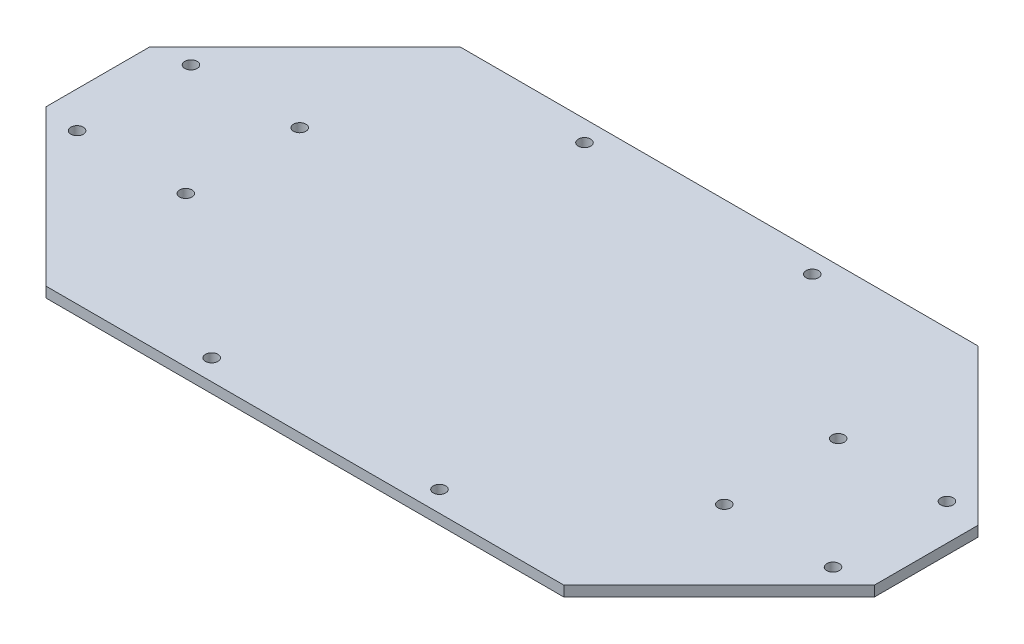
ISO-10303-21;
HEADER;
FILE_DESCRIPTION(('STEP AP214'),'2;1');
FILE_NAME('part.step','',(''),(''),'','','');
FILE_SCHEMA(('AUTOMOTIVE_DESIGN { 1 0 10303 214 1 1 1 1 }'));
ENDSEC;
DATA;
#1=APPLICATION_CONTEXT('core data for automotive mechanical design processes');
#2=APPLICATION_PROTOCOL_DEFINITION('international standard','automotive_design',2000,#1);
#3=PRODUCT_CONTEXT('',#1,'mechanical');
#4=PRODUCT('Part','Part','',(#3));
#5=PRODUCT_RELATED_PRODUCT_CATEGORY('part','',(#4));
#6=PRODUCT_DEFINITION_FORMATION('','',#4);
#7=PRODUCT_DEFINITION_CONTEXT('part definition',#1,'design');
#8=PRODUCT_DEFINITION('design','',#6,#7);
#9=PRODUCT_DEFINITION_SHAPE('','',#8);
#10=(LENGTH_UNIT() NAMED_UNIT(*) SI_UNIT(.MILLI.,.METRE.));
#11=(NAMED_UNIT(*) PLANE_ANGLE_UNIT() SI_UNIT($,.RADIAN.));
#12=(NAMED_UNIT(*) SI_UNIT($,.STERADIAN.) SOLID_ANGLE_UNIT());
#13=UNCERTAINTY_MEASURE_WITH_UNIT(LENGTH_MEASURE(1.E-05),#10,'distance_accuracy_value','');
#14=(GEOMETRIC_REPRESENTATION_CONTEXT(3) GLOBAL_UNCERTAINTY_ASSIGNED_CONTEXT((#13)) GLOBAL_UNIT_ASSIGNED_CONTEXT((#10,
#11,#12)) REPRESENTATION_CONTEXT('',''));
#15=CARTESIAN_POINT('',(0.,0.,0.));
#16=DIRECTION('',(0.,0.,1.));
#17=DIRECTION('',(1.,0.,0.));
#18=AXIS2_PLACEMENT_3D('',#15,#16,#17);
#19=CARTESIAN_POINT('',(0.,2.,0.));
#20=DIRECTION('',(0.,-1.,0.));
#21=DIRECTION('',(0.,0.,-1.));
#22=AXIS2_PLACEMENT_3D('',#19,#20,#21);
#23=PLANE('',#22);
#24=CARTESIAN_POINT('',(7.,2.,-51.0000000000001));
#25=DIRECTION('',(0.,1.,0.));
#26=DIRECTION('',(0.,0.,1.));
#27=AXIS2_PLACEMENT_3D('',#24,#25,#26);
#28=CIRCLE('',#27,1.19999999999999);
#29=CARTESIAN_POINT('',(7.,2.,-49.8000000000001));
#30=VERTEX_POINT('',#29);
#31=EDGE_CURVE('E392',#30,#30,#28,.T.);
#32=ORIENTED_EDGE('',*,*,#31,.F.);
#33=EDGE_LOOP('',(#32));
#34=FACE_BOUND('',#33,.T.);
#35=CARTESIAN_POINT('',(7.00000000000001,2.,-29.0000000000001));
#36=DIRECTION('',(0.,1.,0.));
#37=DIRECTION('',(0.,0.,1.));
#38=AXIS2_PLACEMENT_3D('',#35,#36,#37);
#39=CIRCLE('',#38,1.19999999999999);
#40=CARTESIAN_POINT('',(7.00000000000001,2.,-27.8000000000001));
#41=VERTEX_POINT('',#40);
#42=EDGE_CURVE('E394',#41,#41,#39,.T.);
#43=ORIENTED_EDGE('',*,*,#42,.F.);
#44=EDGE_LOOP('',(#43));
#45=FACE_BOUND('',#44,.T.);
#46=CARTESIAN_POINT('',(28.0000000000016,2.,-50.9999999999996));
#47=DIRECTION('',(0.,1.,0.));
#48=DIRECTION('',(0.,0.,1.));
#49=AXIS2_PLACEMENT_3D('',#46,#47,#48);
#50=CIRCLE('',#49,1.19999999999999);
#51=CARTESIAN_POINT('',(28.0000000000016,2.,-49.7999999999996));
#52=VERTEX_POINT('',#51);
#53=EDGE_CURVE('E408',#52,#52,#50,.T.);
#54=ORIENTED_EDGE('',*,*,#53,.F.);
#55=EDGE_LOOP('',(#54));
#56=FACE_BOUND('',#55,.T.);
#57=CARTESIAN_POINT('',(58.0000000000005,2.,-75.9999999999996));
#58=DIRECTION('',(0.,1.,0.));
#59=DIRECTION('',(0.,0.,1.));
#60=AXIS2_PLACEMENT_3D('',#57,#58,#59);
#61=CIRCLE('',#60,1.19999999999999);
#62=CARTESIAN_POINT('',(58.0000000000005,2.,-74.7999999999996));
#63=VERTEX_POINT('',#62);
#64=EDGE_CURVE('E414',#63,#63,#61,.T.);
#65=ORIENTED_EDGE('',*,*,#64,.F.);
#66=EDGE_LOOP('',(#65));
#67=FACE_BOUND('',#66,.T.);
#68=CARTESIAN_POINT('',(58.0000000000007,2.,-3.99999999999956));
#69=DIRECTION('',(0.,1.,0.));
#70=DIRECTION('',(0.,0.,1.));
#71=AXIS2_PLACEMENT_3D('',#68,#69,#70);
#72=CIRCLE('',#71,1.19999999999999);
#73=CARTESIAN_POINT('',(58.0000000000007,2.,-2.79999999999958));
#74=VERTEX_POINT('',#73);
#75=EDGE_CURVE('E420',#74,#74,#72,.T.);
#76=ORIENTED_EDGE('',*,*,#75,.F.);
#77=EDGE_LOOP('',(#76));
#78=FACE_BOUND('',#77,.T.);
#79=CARTESIAN_POINT('',(131.999999999998,2.,-28.9999999999995));
#80=DIRECTION('',(0.,1.,0.));
#81=DIRECTION('',(0.,0.,1.));
#82=AXIS2_PLACEMENT_3D('',#79,#80,#81);
#83=CIRCLE('',#82,1.19999999999998);
#84=CARTESIAN_POINT('',(131.999999999998,2.,-27.7999999999995));
#85=VERTEX_POINT('',#84);
#86=EDGE_CURVE('E426',#85,#85,#83,.T.);
#87=ORIENTED_EDGE('',*,*,#86,.F.);
#88=EDGE_LOOP('',(#87));
#89=FACE_BOUND('',#88,.T.);
#90=CARTESIAN_POINT('',(153.,2.,-29.0000000000001));
#91=DIRECTION('',(0.,1.,0.));
#92=DIRECTION('',(0.,0.,1.));
#93=AXIS2_PLACEMENT_3D('',#90,#91,#92);
#94=CIRCLE('',#93,1.19999999999998);
#95=CARTESIAN_POINT('',(153.,2.,-27.8000000000001));
#96=VERTEX_POINT('',#95);
#97=EDGE_CURVE('E432',#96,#96,#94,.T.);
#98=ORIENTED_EDGE('',*,*,#97,.F.);
#99=EDGE_LOOP('',(#98));
#100=FACE_BOUND('',#99,.T.);
#101=CARTESIAN_POINT('',(153.,2.,-51.0000000000001));
#102=DIRECTION('',(0.,1.,0.));
#103=DIRECTION('',(0.,0.,1.));
#104=AXIS2_PLACEMENT_3D('',#101,#102,#103);
#105=CIRCLE('',#104,1.19999999999998);
#106=CARTESIAN_POINT('',(153.,2.,-49.8000000000001));
#107=VERTEX_POINT('',#106);
#108=EDGE_CURVE('E438',#107,#107,#105,.T.);
#109=ORIENTED_EDGE('',*,*,#108,.F.);
#110=EDGE_LOOP('',(#109));
#111=FACE_BOUND('',#110,.T.);
#112=CARTESIAN_POINT('',(131.999999999998,2.,-50.9999999999995));
#113=DIRECTION('',(0.,1.,0.));
#114=DIRECTION('',(0.,0.,1.));
#115=AXIS2_PLACEMENT_3D('',#112,#113,#114);
#116=CIRCLE('',#115,1.19999999999998);
#117=CARTESIAN_POINT('',(131.999999999998,2.,-49.7999999999995));
#118=VERTEX_POINT('',#117);
#119=EDGE_CURVE('E444',#118,#118,#116,.T.);
#120=ORIENTED_EDGE('',*,*,#119,.F.);
#121=EDGE_LOOP('',(#120));
#122=FACE_BOUND('',#121,.T.);
#123=CARTESIAN_POINT('',(101.994988581029,2.,-75.9999999999996));
#124=DIRECTION('',(0.,1.,0.));
#125=DIRECTION('',(0.,0.,1.));
#126=AXIS2_PLACEMENT_3D('',#123,#124,#125);
#127=CIRCLE('',#126,1.19999999999999);
#128=CARTESIAN_POINT('',(101.994988581029,2.,-74.7999999999996));
#129=VERTEX_POINT('',#128);
#130=EDGE_CURVE('E450',#129,#129,#127,.T.);
#131=ORIENTED_EDGE('',*,*,#130,.F.);
#132=EDGE_LOOP('',(#131));
#133=FACE_BOUND('',#132,.T.);
#134=CARTESIAN_POINT('',(101.994988581029,2.,-3.99999999999956));
#135=DIRECTION('',(0.,1.,0.));
#136=DIRECTION('',(0.,0.,1.));
#137=AXIS2_PLACEMENT_3D('',#134,#135,#136);
#138=CIRCLE('',#137,1.19999999999999);
#139=CARTESIAN_POINT('',(101.994988581029,2.,-2.79999999999957));
#140=VERTEX_POINT('',#139);
#141=EDGE_CURVE('E456',#140,#140,#138,.T.);
#142=ORIENTED_EDGE('',*,*,#141,.F.);
#143=EDGE_LOOP('',(#142));
#144=FACE_BOUND('',#143,.T.);
#145=DIRECTION('',(1.,0.,0.));
#146=VECTOR('',#145,1.);
#147=CARTESIAN_POINT('',(0.,2.,0.));
#148=LINE('',#147,#146);
#149=CARTESIAN_POINT('',(30.,2.,0.));
#150=VERTEX_POINT('',#149);
#151=CARTESIAN_POINT('',(130.,2.,0.));
#152=VERTEX_POINT('',#151);
#153=EDGE_CURVE('E144',#150,#152,#148,.T.);
#154=ORIENTED_EDGE('',*,*,#153,.T.);
#155=DIRECTION('',(-0.707106781186547,0.,0.707106781186547));
#156=VECTOR('',#155,1.);
#157=CARTESIAN_POINT('',(160.,2.,-30.));
#158=LINE('',#157,#156);
#159=CARTESIAN_POINT('',(160.,2.,-30.));
#160=VERTEX_POINT('',#159);
#161=EDGE_CURVE('E158',#160,#152,#158,.T.);
#162=ORIENTED_EDGE('',*,*,#161,.F.);
#163=DIRECTION('',(0.,0.,-1.));
#164=VECTOR('',#163,1.);
#165=CARTESIAN_POINT('',(160.,2.,0.));
#166=LINE('',#165,#164);
#167=CARTESIAN_POINT('',(160.,2.,-50.));
#168=VERTEX_POINT('',#167);
#169=EDGE_CURVE('E46',#160,#168,#166,.T.);
#170=ORIENTED_EDGE('',*,*,#169,.T.);
#171=DIRECTION('',(0.707106781186547,0.,0.707106781186547));
#172=VECTOR('',#171,1.);
#173=CARTESIAN_POINT('',(160.,2.,-50.));
#174=LINE('',#173,#172);
#175=CARTESIAN_POINT('',(130.,2.,-80.));
#176=VERTEX_POINT('',#175);
#177=EDGE_CURVE('E156',#176,#168,#174,.T.);
#178=ORIENTED_EDGE('',*,*,#177,.F.);
#179=DIRECTION('',(-1.,0.,0.));
#180=VECTOR('',#179,1.);
#181=CARTESIAN_POINT('',(0.,2.,-80.));
#182=LINE('',#181,#180);
#183=CARTESIAN_POINT('',(30.,2.,-80.));
#184=VERTEX_POINT('',#183);
#185=EDGE_CURVE('E11',#176,#184,#182,.T.);
#186=ORIENTED_EDGE('',*,*,#185,.T.);
#187=DIRECTION('',(0.707106781186547,0.,-0.707106781186547));
#188=VECTOR('',#187,1.);
#189=CARTESIAN_POINT('',(30.,2.,-80.));
#190=LINE('',#189,#188);
#191=CARTESIAN_POINT('',(0.,2.,-50.));
#192=VERTEX_POINT('',#191);
#193=EDGE_CURVE('E114',#192,#184,#190,.T.);
#194=ORIENTED_EDGE('',*,*,#193,.F.);
#195=DIRECTION('',(0.,0.,1.));
#196=VECTOR('',#195,1.);
#197=CARTESIAN_POINT('',(0.,2.,0.));
#198=LINE('',#197,#196);
#199=CARTESIAN_POINT('',(0.,2.,-30.));
#200=VERTEX_POINT('',#199);
#201=EDGE_CURVE('E122',#192,#200,#198,.T.);
#202=ORIENTED_EDGE('',*,*,#201,.T.);
#203=DIRECTION('',(-0.707106781186547,0.,-0.707106781186547));
#204=VECTOR('',#203,1.);
#205=CARTESIAN_POINT('',(0.,2.,-30.));
#206=LINE('',#205,#204);
#207=EDGE_CURVE('E175',#150,#200,#206,.T.);
#208=ORIENTED_EDGE('',*,*,#207,.F.);
#209=EDGE_LOOP('',(#154,#162,#170,#178,#186,#194,#202,#208));
#210=FACE_BOUND('',#209,.T.);
#211=CARTESIAN_POINT('',(28.0000000000019,2.,-28.9999999999996));
#212=DIRECTION('',(0.,1.,0.));
#213=DIRECTION('',(0.,0.,1.));
#214=AXIS2_PLACEMENT_3D('',#211,#212,#213);
#215=CIRCLE('',#214,1.19999999999999);
#216=CARTESIAN_POINT('',(28.0000000000019,2.,-27.7999999999996));
#217=VERTEX_POINT('',#216);
#218=EDGE_CURVE('E402',#217,#217,#215,.T.);
#219=ORIENTED_EDGE('',*,*,#218,.F.);
#220=EDGE_LOOP('',(#219));
#221=FACE_BOUND('',#220,.T.);
#222=ADVANCED_FACE('F37',(#34,#45,#56,#67,#78,#89,#100,#111,#122,#133,#144,#210,#221),#23,.F.);
#223=CARTESIAN_POINT('',(0.,0.,0.));
#224=DIRECTION('',(0.,-1.,0.));
#225=DIRECTION('',(0.,0.,-1.));
#226=AXIS2_PLACEMENT_3D('',#223,#224,#225);
#227=PLANE('',#226);
#228=CARTESIAN_POINT('',(7.,0.,-51.0000000000001));
#229=DIRECTION('',(0.,1.,0.));
#230=DIRECTION('',(0.,0.,1.));
#231=AXIS2_PLACEMENT_3D('',#228,#229,#230);
#232=CIRCLE('',#231,1.2);
#233=CARTESIAN_POINT('',(7.,0.,-49.8000000000001));
#234=VERTEX_POINT('',#233);
#235=EDGE_CURVE('E390',#234,#234,#232,.T.);
#236=ORIENTED_EDGE('',*,*,#235,.T.);
#237=EDGE_LOOP('',(#236));
#238=FACE_BOUND('',#237,.T.);
#239=CARTESIAN_POINT('',(7.00000000000001,0.,-29.0000000000001));
#240=DIRECTION('',(0.,1.,0.));
#241=DIRECTION('',(0.,0.,1.));
#242=AXIS2_PLACEMENT_3D('',#239,#240,#241);
#243=CIRCLE('',#242,1.2);
#244=CARTESIAN_POINT('',(7.00000000000001,0.,-27.8000000000001));
#245=VERTEX_POINT('',#244);
#246=EDGE_CURVE('E399',#245,#245,#243,.T.);
#247=ORIENTED_EDGE('',*,*,#246,.T.);
#248=EDGE_LOOP('',(#247));
#249=FACE_BOUND('',#248,.T.);
#250=CARTESIAN_POINT('',(28.0000000000019,0.,-28.9999999999996));
#251=DIRECTION('',(0.,1.,0.));
#252=DIRECTION('',(0.,0.,1.));
#253=AXIS2_PLACEMENT_3D('',#250,#251,#252);
#254=CIRCLE('',#253,1.2);
#255=CARTESIAN_POINT('',(28.0000000000019,0.,-27.7999999999996));
#256=VERTEX_POINT('',#255);
#257=EDGE_CURVE('E405',#256,#256,#254,.T.);
#258=ORIENTED_EDGE('',*,*,#257,.T.);
#259=EDGE_LOOP('',(#258));
#260=FACE_BOUND('',#259,.T.);
#261=CARTESIAN_POINT('',(28.0000000000016,0.,-50.9999999999996));
#262=DIRECTION('',(0.,1.,0.));
#263=DIRECTION('',(0.,0.,1.));
#264=AXIS2_PLACEMENT_3D('',#261,#262,#263);
#265=CIRCLE('',#264,1.2);
#266=CARTESIAN_POINT('',(28.0000000000016,0.,-49.7999999999996));
#267=VERTEX_POINT('',#266);
#268=EDGE_CURVE('E411',#267,#267,#265,.T.);
#269=ORIENTED_EDGE('',*,*,#268,.T.);
#270=EDGE_LOOP('',(#269));
#271=FACE_BOUND('',#270,.T.);
#272=CARTESIAN_POINT('',(58.0000000000005,0.,-75.9999999999996));
#273=DIRECTION('',(0.,1.,0.));
#274=DIRECTION('',(0.,0.,1.));
#275=AXIS2_PLACEMENT_3D('',#272,#273,#274);
#276=CIRCLE('',#275,1.2);
#277=CARTESIAN_POINT('',(58.0000000000005,0.,-74.7999999999996));
#278=VERTEX_POINT('',#277);
#279=EDGE_CURVE('E417',#278,#278,#276,.T.);
#280=ORIENTED_EDGE('',*,*,#279,.T.);
#281=EDGE_LOOP('',(#280));
#282=FACE_BOUND('',#281,.T.);
#283=CARTESIAN_POINT('',(58.0000000000007,0.,-3.99999999999956));
#284=DIRECTION('',(0.,1.,0.));
#285=DIRECTION('',(0.,0.,1.));
#286=AXIS2_PLACEMENT_3D('',#283,#284,#285);
#287=CIRCLE('',#286,1.2);
#288=CARTESIAN_POINT('',(58.0000000000007,0.,-2.79999999999957));
#289=VERTEX_POINT('',#288);
#290=EDGE_CURVE('E423',#289,#289,#287,.T.);
#291=ORIENTED_EDGE('',*,*,#290,.T.);
#292=EDGE_LOOP('',(#291));
#293=FACE_BOUND('',#292,.T.);
#294=CARTESIAN_POINT('',(131.999999999998,0.,-28.9999999999995));
#295=DIRECTION('',(0.,1.,0.));
#296=DIRECTION('',(0.,0.,1.));
#297=AXIS2_PLACEMENT_3D('',#294,#295,#296);
#298=CIRCLE('',#297,1.20000000000001);
#299=CARTESIAN_POINT('',(131.999999999998,0.,-27.7999999999995));
#300=VERTEX_POINT('',#299);
#301=EDGE_CURVE('E429',#300,#300,#298,.T.);
#302=ORIENTED_EDGE('',*,*,#301,.T.);
#303=EDGE_LOOP('',(#302));
#304=FACE_BOUND('',#303,.T.);
#305=DIRECTION('',(-0.707106781186547,0.,0.707106781186547));
#306=VECTOR('',#305,1.);
#307=CARTESIAN_POINT('',(160.,0.,-30.));
#308=LINE('',#307,#306);
#309=CARTESIAN_POINT('',(160.,0.,-30.));
#310=VERTEX_POINT('',#309);
#311=CARTESIAN_POINT('',(130.,0.,0.));
#312=VERTEX_POINT('',#311);
#313=EDGE_CURVE('E168',#310,#312,#308,.T.);
#314=ORIENTED_EDGE('',*,*,#313,.T.);
#315=DIRECTION('',(1.,0.,0.));
#316=VECTOR('',#315,1.);
#317=CARTESIAN_POINT('',(0.,0.,0.));
#318=LINE('',#317,#316);
#319=CARTESIAN_POINT('',(30.,0.,0.));
#320=VERTEX_POINT('',#319);
#321=EDGE_CURVE('E129',#320,#312,#318,.T.);
#322=ORIENTED_EDGE('',*,*,#321,.F.);
#323=DIRECTION('',(-0.707106781186547,0.,-0.707106781186547));
#324=VECTOR('',#323,1.);
#325=CARTESIAN_POINT('',(0.,0.,-30.));
#326=LINE('',#325,#324);
#327=CARTESIAN_POINT('',(0.,0.,-30.));
#328=VERTEX_POINT('',#327);
#329=EDGE_CURVE('E128',#320,#328,#326,.T.);
#330=ORIENTED_EDGE('',*,*,#329,.T.);
#331=DIRECTION('',(0.,0.,1.));
#332=VECTOR('',#331,1.);
#333=CARTESIAN_POINT('',(0.,0.,0.));
#334=LINE('',#333,#332);
#335=CARTESIAN_POINT('',(0.,0.,-50.));
#336=VERTEX_POINT('',#335);
#337=EDGE_CURVE('E120',#336,#328,#334,.T.);
#338=ORIENTED_EDGE('',*,*,#337,.F.);
#339=DIRECTION('',(0.707106781186547,0.,-0.707106781186547));
#340=VECTOR('',#339,1.);
#341=CARTESIAN_POINT('',(30.,0.,-80.));
#342=LINE('',#341,#340);
#343=CARTESIAN_POINT('',(30.,0.,-80.));
#344=VERTEX_POINT('',#343);
#345=EDGE_CURVE('E103',#336,#344,#342,.T.);
#346=ORIENTED_EDGE('',*,*,#345,.T.);
#347=DIRECTION('',(-1.,0.,0.));
#348=VECTOR('',#347,1.);
#349=CARTESIAN_POINT('',(0.,0.,-80.));
#350=LINE('',#349,#348);
#351=CARTESIAN_POINT('',(130.,0.,-80.));
#352=VERTEX_POINT('',#351);
#353=EDGE_CURVE('E41',#352,#344,#350,.T.);
#354=ORIENTED_EDGE('',*,*,#353,.F.);
#355=DIRECTION('',(0.707106781186547,0.,0.707106781186547));
#356=VECTOR('',#355,1.);
#357=CARTESIAN_POINT('',(160.,0.,-50.));
#358=LINE('',#357,#356);
#359=CARTESIAN_POINT('',(160.,0.,-50.));
#360=VERTEX_POINT('',#359);
#361=EDGE_CURVE('E162',#352,#360,#358,.T.);
#362=ORIENTED_EDGE('',*,*,#361,.T.);
#363=DIRECTION('',(0.,0.,-1.));
#364=VECTOR('',#363,1.);
#365=CARTESIAN_POINT('',(160.,0.,0.));
#366=LINE('',#365,#364);
#367=EDGE_CURVE('E133',#310,#360,#366,.T.);
#368=ORIENTED_EDGE('',*,*,#367,.F.);
#369=EDGE_LOOP('',(#314,#322,#330,#338,#346,#354,#362,#368));
#370=FACE_BOUND('',#369,.T.);
#371=CARTESIAN_POINT('',(101.994988581029,0.,-3.99999999999956));
#372=DIRECTION('',(0.,1.,0.));
#373=DIRECTION('',(0.,0.,1.));
#374=AXIS2_PLACEMENT_3D('',#371,#372,#373);
#375=CIRCLE('',#374,1.19999999999999);
#376=CARTESIAN_POINT('',(101.994988581029,0.,-2.79999999999957));
#377=VERTEX_POINT('',#376);
#378=EDGE_CURVE('E171',#377,#377,#375,.T.);
#379=ORIENTED_EDGE('',*,*,#378,.T.);
#380=EDGE_LOOP('',(#379));
#381=FACE_BOUND('',#380,.T.);
#382=CARTESIAN_POINT('',(101.994988581029,0.,-75.9999999999996));
#383=DIRECTION('',(0.,1.,0.));
#384=DIRECTION('',(0.,0.,1.));
#385=AXIS2_PLACEMENT_3D('',#382,#383,#384);
#386=CIRCLE('',#385,1.19999999999999);
#387=CARTESIAN_POINT('',(101.994988581029,0.,-74.7999999999996));
#388=VERTEX_POINT('',#387);
#389=EDGE_CURVE('E453',#388,#388,#386,.T.);
#390=ORIENTED_EDGE('',*,*,#389,.T.);
#391=EDGE_LOOP('',(#390));
#392=FACE_BOUND('',#391,.T.);
#393=CARTESIAN_POINT('',(131.999999999998,0.,-50.9999999999995));
#394=DIRECTION('',(0.,1.,0.));
#395=DIRECTION('',(0.,0.,1.));
#396=AXIS2_PLACEMENT_3D('',#393,#394,#395);
#397=CIRCLE('',#396,1.20000000000001);
#398=CARTESIAN_POINT('',(131.999999999998,0.,-49.7999999999995));
#399=VERTEX_POINT('',#398);
#400=EDGE_CURVE('E447',#399,#399,#397,.T.);
#401=ORIENTED_EDGE('',*,*,#400,.T.);
#402=EDGE_LOOP('',(#401));
#403=FACE_BOUND('',#402,.T.);
#404=CARTESIAN_POINT('',(153.,0.,-51.0000000000001));
#405=DIRECTION('',(0.,1.,0.));
#406=DIRECTION('',(0.,0.,1.));
#407=AXIS2_PLACEMENT_3D('',#404,#405,#406);
#408=CIRCLE('',#407,1.20000000000001);
#409=CARTESIAN_POINT('',(153.,0.,-49.8000000000001));
#410=VERTEX_POINT('',#409);
#411=EDGE_CURVE('E441',#410,#410,#408,.T.);
#412=ORIENTED_EDGE('',*,*,#411,.T.);
#413=EDGE_LOOP('',(#412));
#414=FACE_BOUND('',#413,.T.);
#415=CARTESIAN_POINT('',(153.,0.,-29.0000000000001));
#416=DIRECTION('',(0.,1.,0.));
#417=DIRECTION('',(0.,0.,1.));
#418=AXIS2_PLACEMENT_3D('',#415,#416,#417);
#419=CIRCLE('',#418,1.20000000000001);
#420=CARTESIAN_POINT('',(153.,0.,-27.8000000000001));
#421=VERTEX_POINT('',#420);
#422=EDGE_CURVE('E435',#421,#421,#419,.T.);
#423=ORIENTED_EDGE('',*,*,#422,.T.);
#424=EDGE_LOOP('',(#423));
#425=FACE_BOUND('',#424,.T.);
#426=ADVANCED_FACE('F125',(#238,#249,#260,#271,#282,#293,#304,#370,#381,#392,#403,#414,#425),
#227,.T.);
#427=CARTESIAN_POINT('',(0.,2.,0.));
#428=DIRECTION('',(1.,0.,0.));
#429=DIRECTION('',(0.,0.,-1.));
#430=AXIS2_PLACEMENT_3D('',#427,#428,#429);
#431=PLANE('',#430);
#432=ORIENTED_EDGE('',*,*,#201,.F.);
#433=DIRECTION('',(0.,1.,0.));
#434=VECTOR('',#433,1.);
#435=CARTESIAN_POINT('',(0.,0.,-50.));
#436=LINE('',#435,#434);
#437=EDGE_CURVE('E106',#336,#192,#436,.T.);
#438=ORIENTED_EDGE('',*,*,#437,.F.);
#439=ORIENTED_EDGE('',*,*,#337,.T.);
#440=DIRECTION('',(0.,1.,0.));
#441=VECTOR('',#440,1.);
#442=CARTESIAN_POINT('',(0.,0.,-30.));
#443=LINE('',#442,#441);
#444=EDGE_CURVE('E130',#328,#200,#443,.T.);
#445=ORIENTED_EDGE('',*,*,#444,.T.);
#446=EDGE_LOOP('',(#432,#438,#439,#445));
#447=FACE_BOUND('',#446,.T.);
#448=ADVANCED_FACE('F39',(#447),#431,.F.);
#449=CARTESIAN_POINT('',(0.,2.,0.));
#450=DIRECTION('',(0.,0.,-1.));
#451=DIRECTION('',(-1.,0.,0.));
#452=AXIS2_PLACEMENT_3D('',#449,#450,#451);
#453=PLANE('',#452);
#454=ORIENTED_EDGE('',*,*,#321,.T.);
#455=DIRECTION('',(0.,1.,0.));
#456=VECTOR('',#455,1.);
#457=CARTESIAN_POINT('',(130.,0.,0.));
#458=LINE('',#457,#456);
#459=EDGE_CURVE('E54',#312,#152,#458,.T.);
#460=ORIENTED_EDGE('',*,*,#459,.T.);
#461=ORIENTED_EDGE('',*,*,#153,.F.);
#462=DIRECTION('',(0.,1.,0.));
#463=VECTOR('',#462,1.);
#464=CARTESIAN_POINT('',(30.,0.,0.));
#465=LINE('',#464,#463);
#466=EDGE_CURVE('E135',#320,#150,#465,.T.);
#467=ORIENTED_EDGE('',*,*,#466,.F.);
#468=EDGE_LOOP('',(#454,#460,#461,#467));
#469=FACE_BOUND('',#468,.T.);
#470=ADVANCED_FACE('F183',(#469),#453,.F.);
#471=CARTESIAN_POINT('',(160.,2.,0.));
#472=DIRECTION('',(-1.,0.,0.));
#473=DIRECTION('',(0.,0.,1.));
#474=AXIS2_PLACEMENT_3D('',#471,#472,#473);
#475=PLANE('',#474);
#476=ORIENTED_EDGE('',*,*,#169,.F.);
#477=DIRECTION('',(0.,1.,0.));
#478=VECTOR('',#477,1.);
#479=CARTESIAN_POINT('',(160.,0.,-30.));
#480=LINE('',#479,#478);
#481=EDGE_CURVE('E160',#310,#160,#480,.T.);
#482=ORIENTED_EDGE('',*,*,#481,.F.);
#483=ORIENTED_EDGE('',*,*,#367,.T.);
#484=DIRECTION('',(0.,1.,0.));
#485=VECTOR('',#484,1.);
#486=CARTESIAN_POINT('',(160.,0.,-50.));
#487=LINE('',#486,#485);
#488=EDGE_CURVE('E62',#360,#168,#487,.T.);
#489=ORIENTED_EDGE('',*,*,#488,.T.);
#490=EDGE_LOOP('',(#476,#482,#483,#489));
#491=FACE_BOUND('',#490,.T.);
#492=ADVANCED_FACE('F159',(#491),#475,.F.);
#493=CARTESIAN_POINT('',(0.,2.,-80.));
#494=DIRECTION('',(0.,0.,1.));
#495=DIRECTION('',(1.,0.,0.));
#496=AXIS2_PLACEMENT_3D('',#493,#494,#495);
#497=PLANE('',#496);
#498=ORIENTED_EDGE('',*,*,#185,.F.);
#499=DIRECTION('',(0.,1.,0.));
#500=VECTOR('',#499,1.);
#501=CARTESIAN_POINT('',(130.,0.,-80.));
#502=LINE('',#501,#500);
#503=EDGE_CURVE('E161',#352,#176,#502,.T.);
#504=ORIENTED_EDGE('',*,*,#503,.F.);
#505=ORIENTED_EDGE('',*,*,#353,.T.);
#506=DIRECTION('',(0.,1.,0.));
#507=VECTOR('',#506,1.);
#508=CARTESIAN_POINT('',(30.,0.,-80.));
#509=LINE('',#508,#507);
#510=EDGE_CURVE('E109',#344,#184,#509,.T.);
#511=ORIENTED_EDGE('',*,*,#510,.T.);
#512=EDGE_LOOP('',(#498,#504,#505,#511));
#513=FACE_BOUND('',#512,.T.);
#514=ADVANCED_FACE('F180',(#513),#497,.F.);
#515=CARTESIAN_POINT('',(0.,0.,-30.));
#516=DIRECTION('',(0.707106781186547,0.,-0.707106781186547));
#517=DIRECTION('',(-0.707106781186548,0.,-0.707106781186548));
#518=AXIS2_PLACEMENT_3D('',#515,#516,#517);
#519=PLANE('',#518);
#520=ORIENTED_EDGE('',*,*,#207,.T.);
#521=ORIENTED_EDGE('',*,*,#444,.F.);
#522=ORIENTED_EDGE('',*,*,#329,.F.);
#523=ORIENTED_EDGE('',*,*,#466,.T.);
#524=EDGE_LOOP('',(#520,#521,#522,#523));
#525=FACE_BOUND('',#524,.T.);
#526=ADVANCED_FACE('F185',(#525),#519,.F.);
#527=CARTESIAN_POINT('',(30.,0.,-80.));
#528=DIRECTION('',(0.707106781186547,0.,0.707106781186547));
#529=DIRECTION('',(0.707106781186548,0.,-0.707106781186548));
#530=AXIS2_PLACEMENT_3D('',#527,#528,#529);
#531=PLANE('',#530);
#532=ORIENTED_EDGE('',*,*,#193,.T.);
#533=ORIENTED_EDGE('',*,*,#510,.F.);
#534=ORIENTED_EDGE('',*,*,#345,.F.);
#535=ORIENTED_EDGE('',*,*,#437,.T.);
#536=EDGE_LOOP('',(#532,#533,#534,#535));
#537=FACE_BOUND('',#536,.T.);
#538=ADVANCED_FACE('F105',(#537),#531,.F.);
#539=CARTESIAN_POINT('',(160.,0.,-50.));
#540=DIRECTION('',(-0.707106781186547,0.,0.707106781186547));
#541=DIRECTION('',(0.707106781186548,0.,0.707106781186548));
#542=AXIS2_PLACEMENT_3D('',#539,#540,#541);
#543=PLANE('',#542);
#544=ORIENTED_EDGE('',*,*,#177,.T.);
#545=ORIENTED_EDGE('',*,*,#488,.F.);
#546=ORIENTED_EDGE('',*,*,#361,.F.);
#547=ORIENTED_EDGE('',*,*,#503,.T.);
#548=EDGE_LOOP('',(#544,#545,#546,#547));
#549=FACE_BOUND('',#548,.T.);
#550=ADVANCED_FACE('F179',(#549),#543,.F.);
#551=CARTESIAN_POINT('',(160.,0.,-30.));
#552=DIRECTION('',(-0.707106781186547,0.,-0.707106781186547));
#553=DIRECTION('',(-0.707106781186548,0.,0.707106781186548));
#554=AXIS2_PLACEMENT_3D('',#551,#552,#553);
#555=PLANE('',#554);
#556=ORIENTED_EDGE('',*,*,#161,.T.);
#557=ORIENTED_EDGE('',*,*,#459,.F.);
#558=ORIENTED_EDGE('',*,*,#313,.F.);
#559=ORIENTED_EDGE('',*,*,#481,.T.);
#560=EDGE_LOOP('',(#556,#557,#558,#559));
#561=FACE_BOUND('',#560,.T.);
#562=ADVANCED_FACE('F232',(#561),#555,.F.);
#563=CARTESIAN_POINT('',(101.994988581029,2.,-3.99999999999956));
#564=DIRECTION('',(0.,1.,0.));
#565=DIRECTION('',(0.,0.,1.));
#566=AXIS2_PLACEMENT_3D('',#563,#564,#565);
#567=CYLINDRICAL_SURFACE('',#566,1.19999999999999);
#568=ORIENTED_EDGE('',*,*,#378,.F.);
#569=EDGE_LOOP('',(#568));
#570=FACE_BOUND('',#569,.T.);
#571=ORIENTED_EDGE('',*,*,#141,.T.);
#572=EDGE_LOOP('',(#571));
#573=FACE_BOUND('',#572,.T.);
#574=ADVANCED_FACE('F226',(#570,#573),#567,.F.);
#575=CARTESIAN_POINT('',(101.994988581029,2.,-75.9999999999996));
#576=DIRECTION('',(0.,1.,0.));
#577=DIRECTION('',(0.,0.,1.));
#578=AXIS2_PLACEMENT_3D('',#575,#576,#577);
#579=CYLINDRICAL_SURFACE('',#578,1.19999999999999);
#580=ORIENTED_EDGE('',*,*,#389,.F.);
#581=EDGE_LOOP('',(#580));
#582=FACE_BOUND('',#581,.T.);
#583=ORIENTED_EDGE('',*,*,#130,.T.);
#584=EDGE_LOOP('',(#583));
#585=FACE_BOUND('',#584,.T.);
#586=ADVANCED_FACE('F231',(#582,#585),#579,.F.);
#587=CARTESIAN_POINT('',(131.999999999998,2.,-50.9999999999995));
#588=DIRECTION('',(0.,1.,0.));
#589=DIRECTION('',(0.,0.,1.));
#590=AXIS2_PLACEMENT_3D('',#587,#588,#589);
#591=CYLINDRICAL_SURFACE('',#590,1.19999999999999);
#592=ORIENTED_EDGE('',*,*,#400,.F.);
#593=EDGE_LOOP('',(#592));
#594=FACE_BOUND('',#593,.T.);
#595=ORIENTED_EDGE('',*,*,#119,.T.);
#596=EDGE_LOOP('',(#595));
#597=FACE_BOUND('',#596,.T.);
#598=ADVANCED_FACE('F243',(#594,#597),#591,.F.);
#599=CARTESIAN_POINT('',(153.,2.,-51.0000000000001));
#600=DIRECTION('',(0.,1.,0.));
#601=DIRECTION('',(0.,0.,1.));
#602=AXIS2_PLACEMENT_3D('',#599,#600,#601);
#603=CYLINDRICAL_SURFACE('',#602,1.19999999999999);
#604=ORIENTED_EDGE('',*,*,#411,.F.);
#605=EDGE_LOOP('',(#604));
#606=FACE_BOUND('',#605,.T.);
#607=ORIENTED_EDGE('',*,*,#108,.T.);
#608=EDGE_LOOP('',(#607));
#609=FACE_BOUND('',#608,.T.);
#610=ADVANCED_FACE('F253',(#606,#609),#603,.F.);
#611=CARTESIAN_POINT('',(153.,2.,-29.0000000000001));
#612=DIRECTION('',(0.,1.,0.));
#613=DIRECTION('',(0.,0.,1.));
#614=AXIS2_PLACEMENT_3D('',#611,#612,#613);
#615=CYLINDRICAL_SURFACE('',#614,1.19999999999999);
#616=ORIENTED_EDGE('',*,*,#422,.F.);
#617=EDGE_LOOP('',(#616));
#618=FACE_BOUND('',#617,.T.);
#619=ORIENTED_EDGE('',*,*,#97,.T.);
#620=EDGE_LOOP('',(#619));
#621=FACE_BOUND('',#620,.T.);
#622=ADVANCED_FACE('F263',(#618,#621),#615,.F.);
#623=CARTESIAN_POINT('',(131.999999999998,2.,-28.9999999999995));
#624=DIRECTION('',(0.,1.,0.));
#625=DIRECTION('',(0.,0.,1.));
#626=AXIS2_PLACEMENT_3D('',#623,#624,#625);
#627=CYLINDRICAL_SURFACE('',#626,1.19999999999999);
#628=ORIENTED_EDGE('',*,*,#301,.F.);
#629=EDGE_LOOP('',(#628));
#630=FACE_BOUND('',#629,.T.);
#631=ORIENTED_EDGE('',*,*,#86,.T.);
#632=EDGE_LOOP('',(#631));
#633=FACE_BOUND('',#632,.T.);
#634=ADVANCED_FACE('F273',(#630,#633),#627,.F.);
#635=CARTESIAN_POINT('',(58.0000000000007,2.,-3.99999999999956));
#636=DIRECTION('',(0.,1.,0.));
#637=DIRECTION('',(0.,0.,1.));
#638=AXIS2_PLACEMENT_3D('',#635,#636,#637);
#639=CYLINDRICAL_SURFACE('',#638,1.19999999999999);
#640=ORIENTED_EDGE('',*,*,#290,.F.);
#641=EDGE_LOOP('',(#640));
#642=FACE_BOUND('',#641,.T.);
#643=ORIENTED_EDGE('',*,*,#75,.T.);
#644=EDGE_LOOP('',(#643));
#645=FACE_BOUND('',#644,.T.);
#646=ADVANCED_FACE('F283',(#642,#645),#639,.F.);
#647=CARTESIAN_POINT('',(58.0000000000005,2.,-75.9999999999996));
#648=DIRECTION('',(0.,1.,0.));
#649=DIRECTION('',(0.,0.,1.));
#650=AXIS2_PLACEMENT_3D('',#647,#648,#649);
#651=CYLINDRICAL_SURFACE('',#650,1.19999999999999);
#652=ORIENTED_EDGE('',*,*,#279,.F.);
#653=EDGE_LOOP('',(#652));
#654=FACE_BOUND('',#653,.T.);
#655=ORIENTED_EDGE('',*,*,#64,.T.);
#656=EDGE_LOOP('',(#655));
#657=FACE_BOUND('',#656,.T.);
#658=ADVANCED_FACE('F293',(#654,#657),#651,.F.);
#659=CARTESIAN_POINT('',(28.0000000000016,2.,-50.9999999999996));
#660=DIRECTION('',(0.,1.,0.));
#661=DIRECTION('',(0.,0.,1.));
#662=AXIS2_PLACEMENT_3D('',#659,#660,#661);
#663=CYLINDRICAL_SURFACE('',#662,1.19999999999999);
#664=ORIENTED_EDGE('',*,*,#268,.F.);
#665=EDGE_LOOP('',(#664));
#666=FACE_BOUND('',#665,.T.);
#667=ORIENTED_EDGE('',*,*,#53,.T.);
#668=EDGE_LOOP('',(#667));
#669=FACE_BOUND('',#668,.T.);
#670=ADVANCED_FACE('F303',(#666,#669),#663,.F.);
#671=CARTESIAN_POINT('',(28.0000000000019,2.,-28.9999999999996));
#672=DIRECTION('',(0.,1.,0.));
#673=DIRECTION('',(0.,0.,1.));
#674=AXIS2_PLACEMENT_3D('',#671,#672,#673);
#675=CYLINDRICAL_SURFACE('',#674,1.19999999999999);
#676=ORIENTED_EDGE('',*,*,#257,.F.);
#677=EDGE_LOOP('',(#676));
#678=FACE_BOUND('',#677,.T.);
#679=ORIENTED_EDGE('',*,*,#218,.T.);
#680=EDGE_LOOP('',(#679));
#681=FACE_BOUND('',#680,.T.);
#682=ADVANCED_FACE('F313',(#678,#681),#675,.F.);
#683=CARTESIAN_POINT('',(7.00000000000001,2.,-29.0000000000001));
#684=DIRECTION('',(0.,1.,0.));
#685=DIRECTION('',(0.,0.,1.));
#686=AXIS2_PLACEMENT_3D('',#683,#684,#685);
#687=CYLINDRICAL_SURFACE('',#686,1.19999999999999);
#688=ORIENTED_EDGE('',*,*,#246,.F.);
#689=EDGE_LOOP('',(#688));
#690=FACE_BOUND('',#689,.T.);
#691=ORIENTED_EDGE('',*,*,#42,.T.);
#692=EDGE_LOOP('',(#691));
#693=FACE_BOUND('',#692,.T.);
#694=ADVANCED_FACE('F323',(#690,#693),#687,.F.);
#695=CARTESIAN_POINT('',(7.,2.,-51.0000000000001));
#696=DIRECTION('',(0.,1.,0.));
#697=DIRECTION('',(0.,0.,1.));
#698=AXIS2_PLACEMENT_3D('',#695,#696,#697);
#699=CYLINDRICAL_SURFACE('',#698,1.19999999999999);
#700=ORIENTED_EDGE('',*,*,#235,.F.);
#701=EDGE_LOOP('',(#700));
#702=FACE_BOUND('',#701,.T.);
#703=ORIENTED_EDGE('',*,*,#31,.T.);
#704=EDGE_LOOP('',(#703));
#705=FACE_BOUND('',#704,.T.);
#706=ADVANCED_FACE('F333',(#702,#705),#699,.F.);
#707=CLOSED_SHELL('',(#222,#426,#448,#470,#492,#514,#526,#538,#550,#562,#574,#586,#598,#610,
#622,#634,#646,#658,#670,#682,#694,#706));
#708=MANIFOLD_SOLID_BREP('B2',#707);
#709=ADVANCED_BREP_SHAPE_REPRESENTATION('',(#18,#708),#14);
#710=SHAPE_DEFINITION_REPRESENTATION(#9,#709);
ENDSEC;
END-ISO-10303-21;
